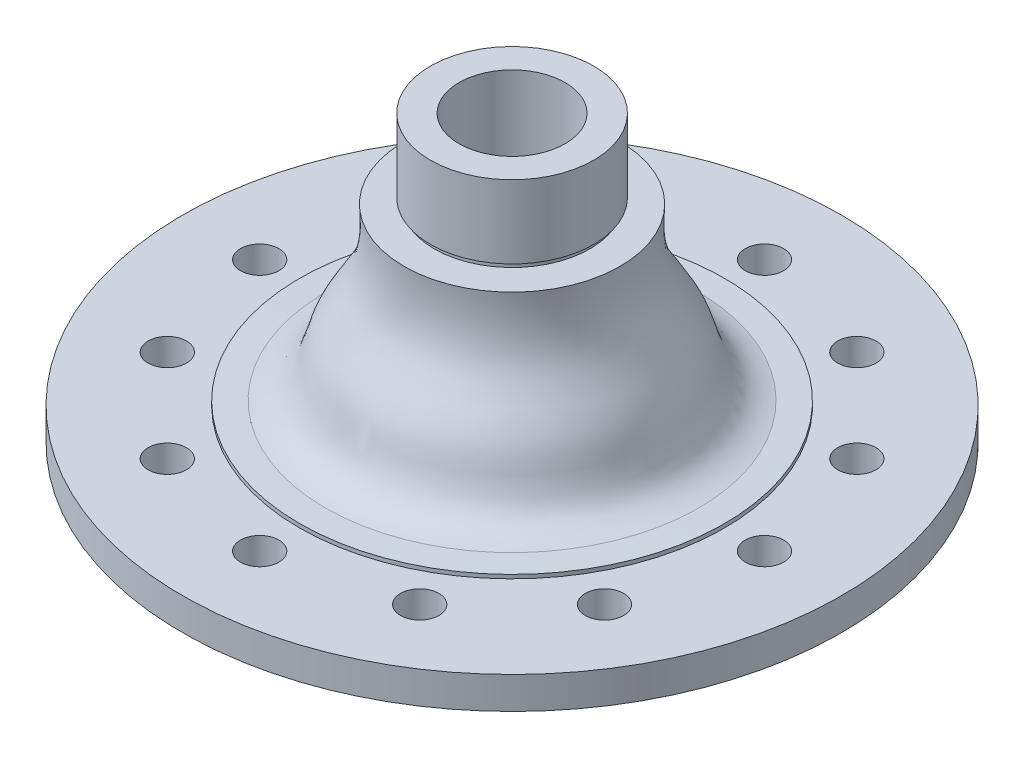
ISO-10303-21;
HEADER;
FILE_DESCRIPTION(('STEP AP214'),'2;1');
FILE_NAME('part.step','',(''),(''),'','','');
FILE_SCHEMA(('AUTOMOTIVE_DESIGN { 1 0 10303 214 1 1 1 1 }'));
ENDSEC;
DATA;
#1=APPLICATION_CONTEXT('core data for automotive mechanical design processes');
#2=APPLICATION_PROTOCOL_DEFINITION('international standard','automotive_design',2000,#1);
#3=PRODUCT_CONTEXT('',#1,'mechanical');
#4=PRODUCT('Part','Part','',(#3));
#5=PRODUCT_RELATED_PRODUCT_CATEGORY('part','',(#4));
#6=PRODUCT_DEFINITION_FORMATION('','',#4);
#7=PRODUCT_DEFINITION_CONTEXT('part definition',#1,'design');
#8=PRODUCT_DEFINITION('design','',#6,#7);
#9=PRODUCT_DEFINITION_SHAPE('','',#8);
#10=(LENGTH_UNIT() NAMED_UNIT(*) SI_UNIT(.MILLI.,.METRE.));
#11=(NAMED_UNIT(*) PLANE_ANGLE_UNIT() SI_UNIT($,.RADIAN.));
#12=(NAMED_UNIT(*) SI_UNIT($,.STERADIAN.) SOLID_ANGLE_UNIT());
#13=UNCERTAINTY_MEASURE_WITH_UNIT(LENGTH_MEASURE(1.E-05),#10,'distance_accuracy_value','');
#14=(GEOMETRIC_REPRESENTATION_CONTEXT(3) GLOBAL_UNCERTAINTY_ASSIGNED_CONTEXT((#13)) GLOBAL_UNIT_ASSIGNED_CONTEXT((#10,
#11,#12)) REPRESENTATION_CONTEXT('',''));
#15=CARTESIAN_POINT('',(0.,0.,0.));
#16=DIRECTION('',(0.,0.,1.));
#17=DIRECTION('',(1.,0.,0.));
#18=AXIS2_PLACEMENT_3D('',#15,#16,#17);
#19=CARTESIAN_POINT('',(599.514440137728,-164.221002071688,0.));
#20=DIRECTION('',(0.,-1.,0.));
#21=DIRECTION('',(0.,0.,-1.));
#22=AXIS2_PLACEMENT_3D('',#19,#20,#21);
#23=CONICAL_SURFACE('',#22,116.160980779473,1.54633855687659);
#24=CARTESIAN_POINT('',(599.514440137728,-163.876181957861,0.));
#25=DIRECTION('',(0.,1.,0.));
#26=DIRECTION('',(0.,0.,1.));
#27=AXIS2_PLACEMENT_3D('',#24,#25,#26);
#28=CIRCLE('',#27,102.065200292674);
#29=CARTESIAN_POINT('',(599.514440137728,-163.876181957861,102.065200292674));
#30=VERTEX_POINT('',#29);
#31=EDGE_CURVE('E10',#30,#30,#28,.T.);
#32=ORIENTED_EDGE('',*,*,#31,.F.);
#33=EDGE_LOOP('',(#32));
#34=FACE_BOUND('',#33,.T.);
#35=CARTESIAN_POINT('',(599.514440137728,-164.221002071688,0.));
#36=DIRECTION('',(0.,1.,0.));
#37=DIRECTION('',(0.,0.,1.));
#38=AXIS2_PLACEMENT_3D('',#35,#36,#37);
#39=CIRCLE('',#38,116.160980779473);
#40=CARTESIAN_POINT('',(599.514440137728,-164.221002071688,116.160980779473));
#41=VERTEX_POINT('',#40);
#42=EDGE_CURVE('E93',#41,#41,#39,.T.);
#43=ORIENTED_EDGE('',*,*,#42,.T.);
#44=EDGE_LOOP('',(#43));
#45=FACE_BOUND('',#44,.T.);
#46=ADVANCED_FACE('F35',(#34,#45),#23,.T.);
#47=CARTESIAN_POINT('',(701.579640430402,-163.876181957861,0.));
#48=CARTESIAN_POINT('',(696.836978512838,-162.87382038747,0.));
#49=CARTESIAN_POINT('',(682.485210268226,-157.676172339236,0.));
#50=CARTESIAN_POINT('',(679.945843963378,-129.423738670763,0.));
#51=CARTESIAN_POINT('',(658.48169900372,-105.854615847683,0.));
#52=CARTESIAN_POINT('',(657.726950227453,-82.125755959732,0.));
#53=CARTESIAN_POINT('',(658.548500631912,-70.9857186283268,0.));
#54=B_SPLINE_CURVE_WITH_KNOTS('',3,(#47,#48,#49,#50,#51,#52,#53),.UNSPECIFIED.,.F.,.F.,(4,1,1,1,
4),(0.,1057.43030810282,2997.11106282431,5402.74320491823,7834.14823487199),.UNSPECIFIED.);
#55=CARTESIAN_POINT('',(599.514440137728,-67.3889032535712,0.));
#56=DIRECTION('',(0.,1.,0.));
#57=AXIS1_PLACEMENT('',#55,#56);
#58=SURFACE_OF_REVOLUTION('',#54,#57);
#59=CARTESIAN_POINT('',(599.514440137728,-70.9857186283268,0.));
#60=DIRECTION('',(0.,1.,0.));
#61=DIRECTION('',(0.,0.,1.));
#62=AXIS2_PLACEMENT_3D('',#59,#60,#61);
#63=CIRCLE('',#62,59.0340604941841);
#64=CARTESIAN_POINT('',(599.514440137728,-70.9857186283268,59.0340604941841));
#65=VERTEX_POINT('',#64);
#66=EDGE_CURVE('E41',#65,#65,#63,.T.);
#67=ORIENTED_EDGE('',*,*,#66,.F.);
#68=EDGE_LOOP('',(#67));
#69=FACE_BOUND('',#68,.T.);
#70=ORIENTED_EDGE('',*,*,#31,.T.);
#71=EDGE_LOOP('',(#70));
#72=FACE_BOUND('',#71,.T.);
#73=ADVANCED_FACE('F150',(#69,#72),#58,.T.);
#74=CARTESIAN_POINT('',(1.78995327775374E-13,-70.9857186283268,0.));
#75=DIRECTION('',(0.,-1.,0.));
#76=DIRECTION('',(0.,0.,-1.));
#77=AXIS2_PLACEMENT_3D('',#74,#75,#76);
#78=PLANE('',#77);
#79=CARTESIAN_POINT('',(599.514440137728,-70.9857186283268,0.));
#80=DIRECTION('',(0.,1.,0.));
#81=DIRECTION('',(0.,0.,1.));
#82=AXIS2_PLACEMENT_3D('',#79,#80,#81);
#83=CIRCLE('',#82,42.5231590183854);
#84=CARTESIAN_POINT('',(599.514440137728,-70.9857186283268,42.5231590183854));
#85=VERTEX_POINT('',#84);
#86=EDGE_CURVE('E45',#85,#85,#83,.T.);
#87=ORIENTED_EDGE('',*,*,#86,.F.);
#88=EDGE_LOOP('',(#87));
#89=FACE_BOUND('',#88,.T.);
#90=ORIENTED_EDGE('',*,*,#66,.T.);
#91=EDGE_LOOP('',(#90));
#92=FACE_BOUND('',#91,.T.);
#93=ADVANCED_FACE('F147',(#89,#92),#78,.F.);
#94=CARTESIAN_POINT('',(599.514440137728,-67.3889032535712,0.));
#95=DIRECTION('',(0.,1.,0.));
#96=DIRECTION('',(0.,0.,1.));
#97=AXIS2_PLACEMENT_3D('',#94,#95,#96);
#98=CYLINDRICAL_SURFACE('',#97,42.5231590183854);
#99=CARTESIAN_POINT('',(599.514440137728,-67.8359145091373,0.));
#100=DIRECTION('',(0.,1.,0.));
#101=DIRECTION('',(0.,0.,1.));
#102=AXIS2_PLACEMENT_3D('',#99,#100,#101);
#103=CIRCLE('',#102,42.5231590183854);
#104=CARTESIAN_POINT('',(599.514440137728,-67.8359145091373,42.5231590183854));
#105=VERTEX_POINT('',#104);
#106=EDGE_CURVE('E49',#105,#105,#103,.T.);
#107=ORIENTED_EDGE('',*,*,#106,.F.);
#108=EDGE_LOOP('',(#107));
#109=FACE_BOUND('',#108,.T.);
#110=ORIENTED_EDGE('',*,*,#86,.T.);
#111=EDGE_LOOP('',(#110));
#112=FACE_BOUND('',#111,.T.);
#113=ADVANCED_FACE('F143',(#109,#112),#98,.T.);
#114=CARTESIAN_POINT('',(0.,-67.8359145091373,0.));
#115=DIRECTION('',(0.,1.,0.));
#116=DIRECTION('',(0.,0.,1.));
#117=AXIS2_PLACEMENT_3D('',#114,#115,#116);
#118=PLANE('',#117);
#119=CARTESIAN_POINT('',(599.514440137728,-67.8359145091373,0.));
#120=DIRECTION('',(0.,1.,0.));
#121=DIRECTION('',(0.,0.,1.));
#122=AXIS2_PLACEMENT_3D('',#119,#120,#121);
#123=CIRCLE('',#122,44.6222250218502);
#124=CARTESIAN_POINT('',(599.514440137728,-67.8359145091373,44.6222250218502));
#125=VERTEX_POINT('',#124);
#126=EDGE_CURVE('E54',#125,#125,#123,.T.);
#127=ORIENTED_EDGE('',*,*,#126,.F.);
#128=EDGE_LOOP('',(#127));
#129=FACE_BOUND('',#128,.T.);
#130=ORIENTED_EDGE('',*,*,#106,.T.);
#131=EDGE_LOOP('',(#130));
#132=FACE_BOUND('',#131,.T.);
#133=ADVANCED_FACE('F139',(#129,#132),#118,.F.);
#134=CARTESIAN_POINT('',(599.514440137728,-67.3889032535712,0.));
#135=DIRECTION('',(0.,1.,0.));
#136=DIRECTION('',(0.,0.,1.));
#137=AXIS2_PLACEMENT_3D('',#134,#135,#136);
#138=CYLINDRICAL_SURFACE('',#137,44.6222250218502);
#139=ORIENTED_EDGE('',*,*,#126,.T.);
#140=EDGE_LOOP('',(#139));
#141=FACE_BOUND('',#140,.T.);
#142=CARTESIAN_POINT('',(599.514440137728,-27.9383956660702,0.));
#143=DIRECTION('',(0.,1.,0.));
#144=DIRECTION('',(0.,0.,1.));
#145=AXIS2_PLACEMENT_3D('',#142,#143,#144);
#146=CIRCLE('',#145,44.6222250218502);
#147=CARTESIAN_POINT('',(599.514440137728,-27.9383956660702,44.6222250218502));
#148=VERTEX_POINT('',#147);
#149=EDGE_CURVE('E57',#148,#148,#146,.T.);
#150=ORIENTED_EDGE('',*,*,#149,.F.);
#151=EDGE_LOOP('',(#150));
#152=FACE_BOUND('',#151,.T.);
#153=ADVANCED_FACE('F135',(#141,#152),#138,.T.);
#154=CARTESIAN_POINT('',(0.,-27.9383956660702,0.));
#155=DIRECTION('',(0.,1.,0.));
#156=DIRECTION('',(0.,0.,1.));
#157=AXIS2_PLACEMENT_3D('',#154,#155,#156);
#158=PLANE('',#157);
#159=ORIENTED_EDGE('',*,*,#149,.T.);
#160=EDGE_LOOP('',(#159));
#161=FACE_BOUND('',#160,.T.);
#162=CARTESIAN_POINT('',(599.514440137728,-27.9383956660702,0.));
#163=DIRECTION('',(0.,1.,0.));
#164=DIRECTION('',(0.,0.,1.));
#165=AXIS2_PLACEMENT_3D('',#162,#163,#164);
#166=CIRCLE('',#165,28.9999999999992);
#167=CARTESIAN_POINT('',(599.514440137728,-27.9383956660702,28.9999999999992));
#168=VERTEX_POINT('',#167);
#169=EDGE_CURVE('E60',#168,#168,#166,.T.);
#170=ORIENTED_EDGE('',*,*,#169,.F.);
#171=EDGE_LOOP('',(#170));
#172=FACE_BOUND('',#171,.T.);
#173=ADVANCED_FACE('F131',(#161,#172),#158,.T.);
#174=CARTESIAN_POINT('',(599.514440137728,-67.3889032535712,0.));
#175=DIRECTION('',(0.,1.,0.));
#176=DIRECTION('',(0.,0.,1.));
#177=AXIS2_PLACEMENT_3D('',#174,#175,#176);
#178=CYLINDRICAL_SURFACE('',#177,28.9999999999994);
#179=ORIENTED_EDGE('',*,*,#169,.T.);
#180=EDGE_LOOP('',(#179));
#181=FACE_BOUND('',#180,.T.);
#182=CARTESIAN_POINT('',(599.514440137728,-106.839410841068,0.));
#183=DIRECTION('',(0.,1.,0.));
#184=DIRECTION('',(0.,0.,1.));
#185=AXIS2_PLACEMENT_3D('',#182,#183,#184);
#186=CIRCLE('',#185,28.9999999999996);
#187=CARTESIAN_POINT('',(599.514440137728,-106.839410841068,28.9999999999996));
#188=VERTEX_POINT('',#187);
#189=EDGE_CURVE('E63',#188,#188,#186,.T.);
#190=ORIENTED_EDGE('',*,*,#189,.F.);
#191=EDGE_LOOP('',(#190));
#192=FACE_BOUND('',#191,.T.);
#193=ADVANCED_FACE('F127',(#181,#192),#178,.F.);
#194=CARTESIAN_POINT('',(0.,-106.839410841068,0.));
#195=DIRECTION('',(0.,-1.,0.));
#196=DIRECTION('',(0.,0.,-1.));
#197=AXIS2_PLACEMENT_3D('',#194,#195,#196);
#198=PLANE('',#197);
#199=ORIENTED_EDGE('',*,*,#189,.T.);
#200=EDGE_LOOP('',(#199));
#201=FACE_BOUND('',#200,.T.);
#202=CARTESIAN_POINT('',(599.514440137728,-106.839410841068,0.));
#203=DIRECTION('',(0.,1.,0.));
#204=DIRECTION('',(0.,0.,1.));
#205=AXIS2_PLACEMENT_3D('',#202,#203,#204);
#206=CIRCLE('',#205,44.6230284311797);
#207=CARTESIAN_POINT('',(599.514440137728,-106.839410841068,44.6230284311797));
#208=VERTEX_POINT('',#207);
#209=EDGE_CURVE('E66',#208,#208,#206,.T.);
#210=ORIENTED_EDGE('',*,*,#209,.F.);
#211=EDGE_LOOP('',(#210));
#212=FACE_BOUND('',#211,.T.);
#213=ADVANCED_FACE('F123',(#201,#212),#198,.T.);
#214=CARTESIAN_POINT('',(599.514440137728,-67.3889032535712,0.));
#215=DIRECTION('',(0.,1.,0.));
#216=DIRECTION('',(0.,0.,1.));
#217=AXIS2_PLACEMENT_3D('',#214,#215,#216);
#218=CYLINDRICAL_SURFACE('',#217,44.6230284311802);
#219=ORIENTED_EDGE('',*,*,#209,.T.);
#220=EDGE_LOOP('',(#219));
#221=FACE_BOUND('',#220,.T.);
#222=CARTESIAN_POINT('',(599.514440137728,-156.607948670613,0.));
#223=DIRECTION('',(0.,1.,0.));
#224=DIRECTION('',(0.,0.,1.));
#225=AXIS2_PLACEMENT_3D('',#222,#223,#224);
#226=CIRCLE('',#225,44.6230284311806);
#227=CARTESIAN_POINT('',(599.514440137728,-156.607948670613,44.6230284311806));
#228=VERTEX_POINT('',#227);
#229=EDGE_CURVE('E69',#228,#228,#226,.T.);
#230=ORIENTED_EDGE('',*,*,#229,.F.);
#231=EDGE_LOOP('',(#230));
#232=FACE_BOUND('',#231,.T.);
#233=ADVANCED_FACE('F119',(#221,#232),#218,.F.);
#234=CARTESIAN_POINT('',(2.72905507681014E-13,-156.607948670613,0.));
#235=DIRECTION('',(0.,-1.,0.));
#236=DIRECTION('',(0.,0.,-1.));
#237=AXIS2_PLACEMENT_3D('',#234,#235,#236);
#238=PLANE('',#237);
#239=ORIENTED_EDGE('',*,*,#229,.T.);
#240=EDGE_LOOP('',(#239));
#241=FACE_BOUND('',#240,.T.);
#242=CARTESIAN_POINT('',(599.514440137728,-156.607948670613,0.));
#243=DIRECTION('',(0.,1.,0.));
#244=DIRECTION('',(0.,0.,1.));
#245=AXIS2_PLACEMENT_3D('',#242,#243,#244);
#246=CIRCLE('',#245,60.5506797207122);
#247=CARTESIAN_POINT('',(599.514440137728,-156.607948670613,60.5506797207122));
#248=VERTEX_POINT('',#247);
#249=EDGE_CURVE('E72',#248,#248,#246,.T.);
#250=ORIENTED_EDGE('',*,*,#249,.F.);
#251=EDGE_LOOP('',(#250));
#252=FACE_BOUND('',#251,.T.);
#253=ADVANCED_FACE('F114',(#241,#252),#238,.T.);
#254=CARTESIAN_POINT('',(660.06511985844,-156.607948670613,0.));
#255=CARTESIAN_POINT('',(663.097961625083,-156.988826470721,0.));
#256=CARTESIAN_POINT('',(667.510654429455,-158.674715159286,0.));
#257=CARTESIAN_POINT('',(674.048768019829,-164.837934220359,0.));
#258=CARTESIAN_POINT('',(674.645699136105,-171.62161598856,0.));
#259=CARTESIAN_POINT('',(673.724213487887,-175.886758840643,0.));
#260=B_SPLINE_CURVE_WITH_KNOTS('',3,(#254,#255,#256,#257,#258,#259),.UNSPECIFIED.,.F.,.F.,(4,1,
1,4),(0.,2126.07147958089,3119.44722831095,6154.52752992671),.UNSPECIFIED.);
#261=CARTESIAN_POINT('',(599.514440137728,-67.3889032535712,0.));
#262=DIRECTION('',(0.,1.,0.));
#263=AXIS1_PLACEMENT('',#261,#262);
#264=SURFACE_OF_REVOLUTION('',#260,#263);
#265=CARTESIAN_POINT('',(599.514440137728,-175.886758840643,0.));
#266=DIRECTION('',(0.,1.,0.));
#267=DIRECTION('',(0.,0.,1.));
#268=AXIS2_PLACEMENT_3D('',#265,#266,#267);
#269=CIRCLE('',#268,74.2097733501593);
#270=CARTESIAN_POINT('',(599.514440137728,-175.886758840643,74.2097733501593));
#271=VERTEX_POINT('',#270);
#272=EDGE_CURVE('E75',#271,#271,#269,.T.);
#273=ORIENTED_EDGE('',*,*,#272,.F.);
#274=EDGE_LOOP('',(#273));
#275=FACE_BOUND('',#274,.T.);
#276=ORIENTED_EDGE('',*,*,#249,.T.);
#277=EDGE_LOOP('',(#276));
#278=FACE_BOUND('',#277,.T.);
#279=ADVANCED_FACE('F109',(#275,#278),#264,.T.);
#280=CARTESIAN_POINT('',(599.514440137728,-207.070159572736,0.));
#281=DIRECTION('',(0.,1.,0.));
#282=DIRECTION('',(0.,0.,1.));
#283=AXIS2_PLACEMENT_3D('',#280,#281,#282);
#284=DEGENERATE_TOROIDAL_SURFACE('',#283,15.3458637109525,66.613544713001,.T.);
#285=ORIENTED_EDGE('',*,*,#272,.T.);
#286=EDGE_LOOP('',(#285));
#287=FACE_BOUND('',#286,.T.);
#288=CARTESIAN_POINT('',(599.514440137728,-199.594402961231,0.));
#289=DIRECTION('',(0.,1.,0.));
#290=DIRECTION('',(0.,0.,1.));
#291=AXIS2_PLACEMENT_3D('',#288,#289,#290);
#292=CIRCLE('',#291,81.5385929364235);
#293=CARTESIAN_POINT('',(599.514440137728,-199.594402961231,81.5385929364235));
#294=VERTEX_POINT('',#293);
#295=EDGE_CURVE('E78',#294,#294,#292,.T.);
#296=ORIENTED_EDGE('',*,*,#295,.F.);
#297=EDGE_LOOP('',(#296));
#298=FACE_BOUND('',#297,.T.);
#299=ADVANCED_FACE('F113',(#287,#298),#284,.F.);
#300=CARTESIAN_POINT('',(0.,-199.594402961231,0.));
#301=DIRECTION('',(0.,-1.,0.));
#302=DIRECTION('',(0.,0.,-1.));
#303=AXIS2_PLACEMENT_3D('',#300,#301,#302);
#304=PLANE('',#303);
#305=ORIENTED_EDGE('',*,*,#295,.T.);
#306=EDGE_LOOP('',(#305));
#307=FACE_BOUND('',#306,.T.);
#308=CARTESIAN_POINT('',(599.514440137728,-199.594402961231,0.));
#309=DIRECTION('',(0.,1.,0.));
#310=DIRECTION('',(0.,0.,1.));
#311=AXIS2_PLACEMENT_3D('',#308,#309,#310);
#312=CIRCLE('',#311,119.41251949035);
#313=CARTESIAN_POINT('',(599.514440137728,-199.594402961231,119.41251949035));
#314=VERTEX_POINT('',#313);
#315=EDGE_CURVE('E81',#314,#314,#312,.T.);
#316=ORIENTED_EDGE('',*,*,#315,.F.);
#317=EDGE_LOOP('',(#316));
#318=FACE_BOUND('',#317,.T.);
#319=ADVANCED_FACE('F190',(#307,#318),#304,.T.);
#320=CARTESIAN_POINT('',(599.514440137728,-67.3889032535712,0.));
#321=DIRECTION('',(0.,1.,0.));
#322=DIRECTION('',(0.,0.,1.));
#323=AXIS2_PLACEMENT_3D('',#320,#321,#322);
#324=CYLINDRICAL_SURFACE('',#323,119.41251949035);
#325=ORIENTED_EDGE('',*,*,#315,.T.);
#326=EDGE_LOOP('',(#325));
#327=FACE_BOUND('',#326,.T.);
#328=CARTESIAN_POINT('',(599.514440137728,-189.09892065135,0.));
#329=DIRECTION('',(0.,1.,0.));
#330=DIRECTION('',(0.,0.,1.));
#331=AXIS2_PLACEMENT_3D('',#328,#329,#330);
#332=CIRCLE('',#331,119.41251949035);
#333=CARTESIAN_POINT('',(599.514440137728,-189.09892065135,119.41251949035));
#334=VERTEX_POINT('',#333);
#335=EDGE_CURVE('E84',#334,#334,#332,.T.);
#336=ORIENTED_EDGE('',*,*,#335,.F.);
#337=EDGE_LOOP('',(#336));
#338=FACE_BOUND('',#337,.T.);
#339=ADVANCED_FACE('F187',(#327,#338),#324,.T.);
#340=CARTESIAN_POINT('',(599.514440137728,-189.098920651352,0.));
#341=DIRECTION('',(0.,1.,0.));
#342=DIRECTION('',(0.,0.,1.));
#343=AXIS2_PLACEMENT_3D('',#340,#341,#342);
#344=TOROIDAL_SURFACE('',#343,124.662193022577,5.24967353222729);
#345=ORIENTED_EDGE('',*,*,#335,.T.);
#346=EDGE_LOOP('',(#345));
#347=FACE_BOUND('',#346,.T.);
#348=CARTESIAN_POINT('',(599.514440137728,-183.849247119125,0.));
#349=DIRECTION('',(0.,1.,0.));
#350=DIRECTION('',(0.,0.,1.));
#351=AXIS2_PLACEMENT_3D('',#348,#349,#350);
#352=CIRCLE('',#351,124.662193020868);
#353=CARTESIAN_POINT('',(599.514440137728,-183.849247119125,124.662193020868));
#354=VERTEX_POINT('',#353);
#355=EDGE_CURVE('E87',#354,#354,#352,.T.);
#356=ORIENTED_EDGE('',*,*,#355,.F.);
#357=EDGE_LOOP('',(#356));
#358=FACE_BOUND('',#357,.T.);
#359=ADVANCED_FACE('F183',(#347,#358),#344,.F.);
#360=CARTESIAN_POINT('',(0.,-183.849247119125,0.));
#361=DIRECTION('',(0.,-1.,0.));
#362=DIRECTION('',(0.,0.,-1.));
#363=AXIS2_PLACEMENT_3D('',#360,#361,#362);
#364=PLANE('',#363);
#365=CARTESIAN_POINT('',(480.002934415475,-183.849247119125,-68.9999999999985));
#366=DIRECTION('',(0.,-1.,0.));
#367=DIRECTION('',(0.,0.,-1.));
#368=AXIS2_PLACEMENT_3D('',#365,#366,#367);
#369=CIRCLE('',#368,10.5);
#370=CARTESIAN_POINT('',(480.002934415475,-183.849247119125,-79.4999999999985));
#371=VERTEX_POINT('',#370);
#372=EDGE_CURVE('E279',#371,#371,#369,.T.);
#373=ORIENTED_EDGE('',*,*,#372,.F.);
#374=EDGE_LOOP('',(#373));
#375=FACE_BOUND('',#374,.T.);
#376=CARTESIAN_POINT('',(530.514440137727,-183.849247119125,-119.511505722252));
#377=DIRECTION('',(0.,-1.,0.));
#378=DIRECTION('',(0.,0.,-1.));
#379=AXIS2_PLACEMENT_3D('',#376,#377,#378);
#380=CIRCLE('',#379,10.5);
#381=CARTESIAN_POINT('',(530.514440137727,-183.849247119125,-130.011505722252));
#382=VERTEX_POINT('',#381);
#383=EDGE_CURVE('E273',#382,#382,#380,.T.);
#384=ORIENTED_EDGE('',*,*,#383,.F.);
#385=EDGE_LOOP('',(#384));
#386=FACE_BOUND('',#385,.T.);
#387=CARTESIAN_POINT('',(599.514440137727,-183.849247119125,-138.));
#388=DIRECTION('',(0.,-1.,0.));
#389=DIRECTION('',(0.,0.,-1.));
#390=AXIS2_PLACEMENT_3D('',#387,#388,#389);
#391=CIRCLE('',#390,10.5);
#392=CARTESIAN_POINT('',(599.514440137727,-183.849247119125,-148.5));
#393=VERTEX_POINT('',#392);
#394=EDGE_CURVE('E267',#393,#393,#391,.T.);
#395=ORIENTED_EDGE('',*,*,#394,.F.);
#396=EDGE_LOOP('',(#395));
#397=FACE_BOUND('',#396,.T.);
#398=CARTESIAN_POINT('',(668.514440137727,-183.849247119125,-119.511505722253));
#399=DIRECTION('',(0.,-1.,0.));
#400=DIRECTION('',(0.,0.,-1.));
#401=AXIS2_PLACEMENT_3D('',#398,#399,#400);
#402=CIRCLE('',#401,10.5);
#403=CARTESIAN_POINT('',(668.514440137727,-183.849247119125,-130.011505722253));
#404=VERTEX_POINT('',#403);
#405=EDGE_CURVE('E261',#404,#404,#402,.T.);
#406=ORIENTED_EDGE('',*,*,#405,.F.);
#407=EDGE_LOOP('',(#406));
#408=FACE_BOUND('',#407,.T.);
#409=CARTESIAN_POINT('',(719.02594585998,-183.849247119125,-69.000000000001));
#410=DIRECTION('',(0.,-1.,0.));
#411=DIRECTION('',(0.,0.,-1.));
#412=AXIS2_PLACEMENT_3D('',#409,#410,#411);
#413=CIRCLE('',#412,10.5);
#414=CARTESIAN_POINT('',(719.02594585998,-183.849247119125,-79.500000000001));
#415=VERTEX_POINT('',#414);
#416=EDGE_CURVE('E255',#415,#415,#413,.T.);
#417=ORIENTED_EDGE('',*,*,#416,.F.);
#418=EDGE_LOOP('',(#417));
#419=FACE_BOUND('',#418,.T.);
#420=CARTESIAN_POINT('',(737.514440137728,-183.849247119125,0.));
#421=DIRECTION('',(0.,-1.,0.));
#422=DIRECTION('',(0.,0.,-1.));
#423=AXIS2_PLACEMENT_3D('',#420,#421,#422);
#424=CIRCLE('',#423,10.5);
#425=CARTESIAN_POINT('',(737.514440137728,-183.849247119125,-10.5));
#426=VERTEX_POINT('',#425);
#427=EDGE_CURVE('E249',#426,#426,#424,.T.);
#428=ORIENTED_EDGE('',*,*,#427,.F.);
#429=EDGE_LOOP('',(#428));
#430=FACE_BOUND('',#429,.T.);
#431=CARTESIAN_POINT('',(719.025945859981,-183.849247119125,68.9999999999993));
#432=DIRECTION('',(0.,-1.,0.));
#433=DIRECTION('',(0.,0.,-1.));
#434=AXIS2_PLACEMENT_3D('',#431,#432,#433);
#435=CIRCLE('',#434,10.5);
#436=CARTESIAN_POINT('',(719.025945859981,-183.849247119125,58.4999999999993));
#437=VERTEX_POINT('',#436);
#438=EDGE_CURVE('E243',#437,#437,#435,.T.);
#439=ORIENTED_EDGE('',*,*,#438,.F.);
#440=EDGE_LOOP('',(#439));
#441=FACE_BOUND('',#440,.T.);
#442=CARTESIAN_POINT('',(668.514440137729,-183.849247119125,119.511505722252));
#443=DIRECTION('',(0.,-1.,0.));
#444=DIRECTION('',(0.,0.,-1.));
#445=AXIS2_PLACEMENT_3D('',#442,#443,#444);
#446=CIRCLE('',#445,10.5);
#447=CARTESIAN_POINT('',(668.514440137729,-183.849247119125,109.011505722252));
#448=VERTEX_POINT('',#447);
#449=EDGE_CURVE('E237',#448,#448,#446,.T.);
#450=ORIENTED_EDGE('',*,*,#449,.F.);
#451=EDGE_LOOP('',(#450));
#452=FACE_BOUND('',#451,.T.);
#453=CARTESIAN_POINT('',(599.514440137729,-183.849247119125,138.));
#454=DIRECTION('',(0.,-1.,0.));
#455=DIRECTION('',(0.,0.,-1.));
#456=AXIS2_PLACEMENT_3D('',#453,#454,#455);
#457=CIRCLE('',#456,10.5);
#458=CARTESIAN_POINT('',(599.514440137729,-183.849247119125,127.5));
#459=VERTEX_POINT('',#458);
#460=EDGE_CURVE('E231',#459,#459,#457,.T.);
#461=ORIENTED_EDGE('',*,*,#460,.F.);
#462=EDGE_LOOP('',(#461));
#463=FACE_BOUND('',#462,.T.);
#464=CARTESIAN_POINT('',(530.514440137728,-183.849247119125,119.511505722253));
#465=DIRECTION('',(0.,-1.,0.));
#466=DIRECTION('',(0.,0.,-1.));
#467=AXIS2_PLACEMENT_3D('',#464,#465,#466);
#468=CIRCLE('',#467,10.5);
#469=CARTESIAN_POINT('',(530.514440137728,-183.849247119125,109.011505722253));
#470=VERTEX_POINT('',#469);
#471=EDGE_CURVE('E225',#470,#470,#468,.T.);
#472=ORIENTED_EDGE('',*,*,#471,.F.);
#473=EDGE_LOOP('',(#472));
#474=FACE_BOUND('',#473,.T.);
#475=CARTESIAN_POINT('',(480.002934415476,-183.849247119125,69.0000000000001));
#476=DIRECTION('',(0.,-1.,0.));
#477=DIRECTION('',(0.,0.,-1.));
#478=AXIS2_PLACEMENT_3D('',#475,#476,#477);
#479=CIRCLE('',#478,10.5);
#480=CARTESIAN_POINT('',(480.002934415476,-183.849247119125,58.5000000000001));
#481=VERTEX_POINT('',#480);
#482=EDGE_CURVE('E219',#481,#481,#479,.T.);
#483=ORIENTED_EDGE('',*,*,#482,.F.);
#484=EDGE_LOOP('',(#483));
#485=FACE_BOUND('',#484,.T.);
#486=CARTESIAN_POINT('',(461.514440137728,-183.849247119125,0.));
#487=DIRECTION('',(0.,-1.,0.));
#488=DIRECTION('',(0.,0.,-1.));
#489=AXIS2_PLACEMENT_3D('',#486,#487,#488);
#490=CIRCLE('',#489,10.5);
#491=CARTESIAN_POINT('',(461.514440137728,-183.849247119125,-10.5));
#492=VERTEX_POINT('',#491);
#493=EDGE_CURVE('E211',#492,#492,#490,.T.);
#494=ORIENTED_EDGE('',*,*,#493,.F.);
#495=EDGE_LOOP('',(#494));
#496=FACE_BOUND('',#495,.T.);
#497=ORIENTED_EDGE('',*,*,#355,.T.);
#498=EDGE_LOOP('',(#497));
#499=FACE_BOUND('',#498,.T.);
#500=CARTESIAN_POINT('',(599.514440137728,-183.849247119125,0.));
#501=DIRECTION('',(0.,-1.,0.));
#502=DIRECTION('',(0.,0.,-1.));
#503=AXIS2_PLACEMENT_3D('',#500,#501,#502);
#504=CIRCLE('',#503,180.194972746709);
#505=CARTESIAN_POINT('',(599.514440137728,-183.849247119125,-180.194972746709));
#506=VERTEX_POINT('',#505);
#507=EDGE_CURVE('E96',#506,#506,#504,.T.);
#508=ORIENTED_EDGE('',*,*,#507,.T.);
#509=EDGE_LOOP('',(#508));
#510=FACE_BOUND('',#509,.T.);
#511=ADVANCED_FACE('F176',(#375,#386,#397,#408,#419,#430,#441,#452,#463,#474,#485,#496,#499,
#510),#364,.T.);
#512=CARTESIAN_POINT('',(0.,-166.320871484481,0.));
#513=DIRECTION('',(0.,1.,0.));
#514=DIRECTION('',(0.,0.,1.));
#515=AXIS2_PLACEMENT_3D('',#512,#513,#514);
#516=PLANE('',#515);
#517=CARTESIAN_POINT('',(480.002934415475,-166.320871484481,-68.9999999999985));
#518=DIRECTION('',(0.,1.,0.));
#519=DIRECTION('',(-0.499999999999989,0.,0.866025403784445));
#520=AXIS2_PLACEMENT_3D('',#517,#518,#519);
#521=CIRCLE('',#520,10.5);
#522=CARTESIAN_POINT('',(474.752934415475,-166.320871484481,-59.9067332602618));
#523=VERTEX_POINT('',#522);
#524=EDGE_CURVE('E282',#523,#523,#521,.T.);
#525=ORIENTED_EDGE('',*,*,#524,.F.);
#526=EDGE_LOOP('',(#525));
#527=FACE_BOUND('',#526,.T.);
#528=CARTESIAN_POINT('',(530.514440137727,-166.320871484481,-119.511505722252));
#529=DIRECTION('',(0.,1.,0.));
#530=DIRECTION('',(-0.866025403784433,0.,0.50000000000001));
#531=AXIS2_PLACEMENT_3D('',#528,#529,#530);
#532=CIRCLE('',#531,10.5);
#533=CARTESIAN_POINT('',(521.42117339799,-166.320871484481,-114.261505722252));
#534=VERTEX_POINT('',#533);
#535=EDGE_CURVE('E276',#534,#534,#532,.T.);
#536=ORIENTED_EDGE('',*,*,#535,.F.);
#537=EDGE_LOOP('',(#536));
#538=FACE_BOUND('',#537,.T.);
#539=CARTESIAN_POINT('',(599.514440137727,-166.320871484481,-138.));
#540=DIRECTION('',(0.,1.,0.));
#541=DIRECTION('',(-1.,0.,0.));
#542=AXIS2_PLACEMENT_3D('',#539,#540,#541);
#543=CIRCLE('',#542,10.5);
#544=CARTESIAN_POINT('',(589.014440137727,-166.320871484481,-138.));
#545=VERTEX_POINT('',#544);
#546=EDGE_CURVE('E270',#545,#545,#543,.T.);
#547=ORIENTED_EDGE('',*,*,#546,.F.);
#548=EDGE_LOOP('',(#547));
#549=FACE_BOUND('',#548,.T.);
#550=CARTESIAN_POINT('',(668.514440137727,-166.320871484481,-119.511505722253));
#551=DIRECTION('',(0.,1.,0.));
#552=DIRECTION('',(-0.866025403784443,0.,-0.499999999999992));
#553=AXIS2_PLACEMENT_3D('',#550,#551,#552);
#554=CIRCLE('',#553,10.5);
#555=CARTESIAN_POINT('',(659.42117339799,-166.320871484481,-124.761505722253));
#556=VERTEX_POINT('',#555);
#557=EDGE_CURVE('E264',#556,#556,#554,.T.);
#558=ORIENTED_EDGE('',*,*,#557,.F.);
#559=EDGE_LOOP('',(#558));
#560=FACE_BOUND('',#559,.T.);
#561=CARTESIAN_POINT('',(719.02594585998,-166.320871484481,-69.000000000001));
#562=DIRECTION('',(0.,1.,0.));
#563=DIRECTION('',(-0.500000000000007,0.,-0.866025403784435));
#564=AXIS2_PLACEMENT_3D('',#561,#562,#563);
#565=CIRCLE('',#564,10.5);
#566=CARTESIAN_POINT('',(713.77594585998,-166.320871484481,-78.0932667397376));
#567=VERTEX_POINT('',#566);
#568=EDGE_CURVE('E258',#567,#567,#565,.T.);
#569=ORIENTED_EDGE('',*,*,#568,.F.);
#570=EDGE_LOOP('',(#569));
#571=FACE_BOUND('',#570,.T.);
#572=CARTESIAN_POINT('',(737.514440137728,-166.320871484481,0.));
#573=DIRECTION('',(0.,1.,0.));
#574=DIRECTION('',(0.,0.,-1.));
#575=AXIS2_PLACEMENT_3D('',#572,#573,#574);
#576=CIRCLE('',#575,10.5);
#577=CARTESIAN_POINT('',(737.514440137728,-166.320871484481,-10.5));
#578=VERTEX_POINT('',#577);
#579=EDGE_CURVE('E252',#578,#578,#576,.T.);
#580=ORIENTED_EDGE('',*,*,#579,.F.);
#581=EDGE_LOOP('',(#580));
#582=FACE_BOUND('',#581,.T.);
#583=CARTESIAN_POINT('',(719.025945859981,-166.320871484481,68.9999999999993));
#584=DIRECTION('',(0.,1.,0.));
#585=DIRECTION('',(0.499999999999995,0.,-0.866025403784442));
#586=AXIS2_PLACEMENT_3D('',#583,#584,#585);
#587=CIRCLE('',#586,10.5);
#588=CARTESIAN_POINT('',(724.275945859981,-166.320871484481,59.9067332602626));
#589=VERTEX_POINT('',#588);
#590=EDGE_CURVE('E246',#589,#589,#587,.T.);
#591=ORIENTED_EDGE('',*,*,#590,.F.);
#592=EDGE_LOOP('',(#591));
#593=FACE_BOUND('',#592,.T.);
#594=CARTESIAN_POINT('',(668.514440137729,-166.320871484481,119.511505722252));
#595=DIRECTION('',(0.,1.,0.));
#596=DIRECTION('',(0.866025403784436,0.,-0.500000000000004));
#597=AXIS2_PLACEMENT_3D('',#594,#595,#596);
#598=CIRCLE('',#597,10.5);
#599=CARTESIAN_POINT('',(677.607706877465,-166.320871484481,114.261505722252));
#600=VERTEX_POINT('',#599);
#601=EDGE_CURVE('E240',#600,#600,#598,.T.);
#602=ORIENTED_EDGE('',*,*,#601,.F.);
#603=EDGE_LOOP('',(#602));
#604=FACE_BOUND('',#603,.T.);
#605=CARTESIAN_POINT('',(599.514440137729,-166.320871484481,138.));
#606=DIRECTION('',(0.,1.,0.));
#607=DIRECTION('',(1.,0.,0.));
#608=AXIS2_PLACEMENT_3D('',#605,#606,#607);
#609=CIRCLE('',#608,10.5);
#610=CARTESIAN_POINT('',(610.014440137729,-166.320871484481,138.));
#611=VERTEX_POINT('',#610);
#612=EDGE_CURVE('E234',#611,#611,#609,.T.);
#613=ORIENTED_EDGE('',*,*,#612,.F.);
#614=EDGE_LOOP('',(#613));
#615=FACE_BOUND('',#614,.T.);
#616=CARTESIAN_POINT('',(530.514440137728,-166.320871484481,119.511505722253));
#617=DIRECTION('',(0.,1.,0.));
#618=DIRECTION('',(0.86602540378444,0.,0.499999999999998));
#619=AXIS2_PLACEMENT_3D('',#616,#617,#618);
#620=CIRCLE('',#619,10.5);
#621=CARTESIAN_POINT('',(539.607706877465,-166.320871484481,124.761505722253));
#622=VERTEX_POINT('',#621);
#623=EDGE_CURVE('E228',#622,#622,#620,.T.);
#624=ORIENTED_EDGE('',*,*,#623,.F.);
#625=EDGE_LOOP('',(#624));
#626=FACE_BOUND('',#625,.T.);
#627=CARTESIAN_POINT('',(480.002934415476,-166.320871484481,69.0000000000001));
#628=DIRECTION('',(0.,1.,0.));
#629=DIRECTION('',(0.500000000000001,0.,0.866025403784438));
#630=AXIS2_PLACEMENT_3D('',#627,#628,#629);
#631=CIRCLE('',#630,10.5);
#632=CARTESIAN_POINT('',(485.252934415476,-166.320871484481,78.0932667397367));
#633=VERTEX_POINT('',#632);
#634=EDGE_CURVE('E222',#633,#633,#631,.T.);
#635=ORIENTED_EDGE('',*,*,#634,.F.);
#636=EDGE_LOOP('',(#635));
#637=FACE_BOUND('',#636,.T.);
#638=CARTESIAN_POINT('',(461.514440137728,-166.320871484481,0.));
#639=DIRECTION('',(0.,1.,0.));
#640=DIRECTION('',(0.,0.,1.));
#641=AXIS2_PLACEMENT_3D('',#638,#639,#640);
#642=CIRCLE('',#641,10.5);
#643=CARTESIAN_POINT('',(461.514440137728,-166.320871484481,10.5));
#644=VERTEX_POINT('',#643);
#645=EDGE_CURVE('E216',#644,#644,#642,.T.);
#646=ORIENTED_EDGE('',*,*,#645,.F.);
#647=EDGE_LOOP('',(#646));
#648=FACE_BOUND('',#647,.T.);
#649=CARTESIAN_POINT('',(599.514440137728,-166.320871484481,0.));
#650=DIRECTION('',(0.,1.,0.));
#651=DIRECTION('',(0.,0.,1.));
#652=AXIS2_PLACEMENT_3D('',#649,#650,#651);
#653=CIRCLE('',#652,116.160980779472);
#654=CARTESIAN_POINT('',(599.514440137728,-166.320871484481,116.160980779472));
#655=VERTEX_POINT('',#654);
#656=EDGE_CURVE('E90',#655,#655,#653,.T.);
#657=ORIENTED_EDGE('',*,*,#656,.F.);
#658=EDGE_LOOP('',(#657));
#659=FACE_BOUND('',#658,.T.);
#660=CARTESIAN_POINT('',(599.514440137728,-166.320871484481,0.));
#661=DIRECTION('',(0.,-1.,0.));
#662=DIRECTION('',(0.,0.,-1.));
#663=AXIS2_PLACEMENT_3D('',#660,#661,#662);
#664=CIRCLE('',#663,180.194972746709);
#665=CARTESIAN_POINT('',(599.514440137728,-166.320871484481,-180.194972746709));
#666=VERTEX_POINT('',#665);
#667=EDGE_CURVE('E209',#666,#666,#664,.T.);
#668=ORIENTED_EDGE('',*,*,#667,.F.);
#669=EDGE_LOOP('',(#668));
#670=FACE_BOUND('',#669,.T.);
#671=ADVANCED_FACE('F166',(#527,#538,#549,#560,#571,#582,#593,#604,#615,#626,#637,#648,#659,
#670),#516,.T.);
#672=CARTESIAN_POINT('',(599.514440137728,-67.3889032535712,0.));
#673=DIRECTION('',(0.,1.,0.));
#674=DIRECTION('',(0.,0.,1.));
#675=AXIS2_PLACEMENT_3D('',#672,#673,#674);
#676=CYLINDRICAL_SURFACE('',#675,116.160980779473);
#677=ORIENTED_EDGE('',*,*,#656,.T.);
#678=EDGE_LOOP('',(#677));
#679=FACE_BOUND('',#678,.T.);
#680=ORIENTED_EDGE('',*,*,#42,.F.);
#681=EDGE_LOOP('',(#680));
#682=FACE_BOUND('',#681,.T.);
#683=ADVANCED_FACE('F163',(#679,#682),#676,.T.);
#684=CARTESIAN_POINT('',(599.514440137728,-67.8359145091373,0.));
#685=DIRECTION('',(0.,-1.,0.));
#686=DIRECTION('',(0.,0.,-1.));
#687=AXIS2_PLACEMENT_3D('',#684,#685,#686);
#688=CYLINDRICAL_SURFACE('',#687,180.194972746709);
#689=ORIENTED_EDGE('',*,*,#507,.F.);
#690=EDGE_LOOP('',(#689));
#691=FACE_BOUND('',#690,.T.);
#692=ORIENTED_EDGE('',*,*,#667,.T.);
#693=EDGE_LOOP('',(#692));
#694=FACE_BOUND('',#693,.T.);
#695=ADVANCED_FACE('F165',(#691,#694),#688,.T.);
#696=CARTESIAN_POINT('',(461.514440137728,-196.320871484481,0.));
#697=DIRECTION('',(0.,1.,0.));
#698=DIRECTION('',(0.,0.,1.));
#699=AXIS2_PLACEMENT_3D('',#696,#697,#698);
#700=CYLINDRICAL_SURFACE('',#699,10.5);
#701=ORIENTED_EDGE('',*,*,#493,.T.);
#702=EDGE_LOOP('',(#701));
#703=FACE_BOUND('',#702,.T.);
#704=ORIENTED_EDGE('',*,*,#645,.T.);
#705=EDGE_LOOP('',(#704));
#706=FACE_BOUND('',#705,.T.);
#707=ADVANCED_FACE('F173',(#703,#706),#700,.F.);
#708=CARTESIAN_POINT('',(480.002934415476,-196.320871484481,69.0000000000001));
#709=DIRECTION('',(0.,1.,0.));
#710=DIRECTION('',(0.,0.,1.));
#711=AXIS2_PLACEMENT_3D('',#708,#709,#710);
#712=CYLINDRICAL_SURFACE('',#711,10.5);
#713=ORIENTED_EDGE('',*,*,#482,.T.);
#714=EDGE_LOOP('',(#713));
#715=FACE_BOUND('',#714,.T.);
#716=ORIENTED_EDGE('',*,*,#634,.T.);
#717=EDGE_LOOP('',(#716));
#718=FACE_BOUND('',#717,.T.);
#719=ADVANCED_FACE('F316',(#715,#718),#712,.F.);
#720=CARTESIAN_POINT('',(530.514440137728,-196.320871484481,119.511505722253));
#721=DIRECTION('',(0.,1.,0.));
#722=DIRECTION('',(0.,0.,1.));
#723=AXIS2_PLACEMENT_3D('',#720,#721,#722);
#724=CYLINDRICAL_SURFACE('',#723,10.5);
#725=ORIENTED_EDGE('',*,*,#471,.T.);
#726=EDGE_LOOP('',(#725));
#727=FACE_BOUND('',#726,.T.);
#728=ORIENTED_EDGE('',*,*,#623,.T.);
#729=EDGE_LOOP('',(#728));
#730=FACE_BOUND('',#729,.T.);
#731=ADVANCED_FACE('F321',(#727,#730),#724,.F.);
#732=CARTESIAN_POINT('',(599.514440137729,-196.320871484481,138.));
#733=DIRECTION('',(0.,1.,0.));
#734=DIRECTION('',(0.,0.,1.));
#735=AXIS2_PLACEMENT_3D('',#732,#733,#734);
#736=CYLINDRICAL_SURFACE('',#735,10.5);
#737=ORIENTED_EDGE('',*,*,#460,.T.);
#738=EDGE_LOOP('',(#737));
#739=FACE_BOUND('',#738,.T.);
#740=ORIENTED_EDGE('',*,*,#612,.T.);
#741=EDGE_LOOP('',(#740));
#742=FACE_BOUND('',#741,.T.);
#743=ADVANCED_FACE('F327',(#739,#742),#736,.F.);
#744=CARTESIAN_POINT('',(668.514440137729,-196.320871484481,119.511505722252));
#745=DIRECTION('',(0.,1.,0.));
#746=DIRECTION('',(0.,0.,1.));
#747=AXIS2_PLACEMENT_3D('',#744,#745,#746);
#748=CYLINDRICAL_SURFACE('',#747,10.5);
#749=ORIENTED_EDGE('',*,*,#449,.T.);
#750=EDGE_LOOP('',(#749));
#751=FACE_BOUND('',#750,.T.);
#752=ORIENTED_EDGE('',*,*,#601,.T.);
#753=EDGE_LOOP('',(#752));
#754=FACE_BOUND('',#753,.T.);
#755=ADVANCED_FACE('F331',(#751,#754),#748,.F.);
#756=CARTESIAN_POINT('',(719.025945859981,-196.320871484481,68.9999999999993));
#757=DIRECTION('',(0.,1.,0.));
#758=DIRECTION('',(0.,0.,1.));
#759=AXIS2_PLACEMENT_3D('',#756,#757,#758);
#760=CYLINDRICAL_SURFACE('',#759,10.5);
#761=ORIENTED_EDGE('',*,*,#438,.T.);
#762=EDGE_LOOP('',(#761));
#763=FACE_BOUND('',#762,.T.);
#764=ORIENTED_EDGE('',*,*,#590,.T.);
#765=EDGE_LOOP('',(#764));
#766=FACE_BOUND('',#765,.T.);
#767=ADVANCED_FACE('F335',(#763,#766),#760,.F.);
#768=CARTESIAN_POINT('',(737.514440137728,-196.320871484481,0.));
#769=DIRECTION('',(0.,1.,0.));
#770=DIRECTION('',(0.,0.,1.));
#771=AXIS2_PLACEMENT_3D('',#768,#769,#770);
#772=CYLINDRICAL_SURFACE('',#771,10.5);
#773=ORIENTED_EDGE('',*,*,#427,.T.);
#774=EDGE_LOOP('',(#773));
#775=FACE_BOUND('',#774,.T.);
#776=ORIENTED_EDGE('',*,*,#579,.T.);
#777=EDGE_LOOP('',(#776));
#778=FACE_BOUND('',#777,.T.);
#779=ADVANCED_FACE('F339',(#775,#778),#772,.F.);
#780=CARTESIAN_POINT('',(719.02594585998,-196.320871484481,-69.000000000001));
#781=DIRECTION('',(0.,1.,0.));
#782=DIRECTION('',(0.,0.,1.));
#783=AXIS2_PLACEMENT_3D('',#780,#781,#782);
#784=CYLINDRICAL_SURFACE('',#783,10.5);
#785=ORIENTED_EDGE('',*,*,#416,.T.);
#786=EDGE_LOOP('',(#785));
#787=FACE_BOUND('',#786,.T.);
#788=ORIENTED_EDGE('',*,*,#568,.T.);
#789=EDGE_LOOP('',(#788));
#790=FACE_BOUND('',#789,.T.);
#791=ADVANCED_FACE('F343',(#787,#790),#784,.F.);
#792=CARTESIAN_POINT('',(668.514440137727,-196.320871484481,-119.511505722253));
#793=DIRECTION('',(0.,1.,0.));
#794=DIRECTION('',(0.,0.,1.));
#795=AXIS2_PLACEMENT_3D('',#792,#793,#794);
#796=CYLINDRICAL_SURFACE('',#795,10.5);
#797=ORIENTED_EDGE('',*,*,#405,.T.);
#798=EDGE_LOOP('',(#797));
#799=FACE_BOUND('',#798,.T.);
#800=ORIENTED_EDGE('',*,*,#557,.T.);
#801=EDGE_LOOP('',(#800));
#802=FACE_BOUND('',#801,.T.);
#803=ADVANCED_FACE('F347',(#799,#802),#796,.F.);
#804=CARTESIAN_POINT('',(599.514440137727,-196.320871484481,-138.));
#805=DIRECTION('',(0.,1.,0.));
#806=DIRECTION('',(0.,0.,1.));
#807=AXIS2_PLACEMENT_3D('',#804,#805,#806);
#808=CYLINDRICAL_SURFACE('',#807,10.5);
#809=ORIENTED_EDGE('',*,*,#394,.T.);
#810=EDGE_LOOP('',(#809));
#811=FACE_BOUND('',#810,.T.);
#812=ORIENTED_EDGE('',*,*,#546,.T.);
#813=EDGE_LOOP('',(#812));
#814=FACE_BOUND('',#813,.T.);
#815=ADVANCED_FACE('F351',(#811,#814),#808,.F.);
#816=CARTESIAN_POINT('',(530.514440137727,-196.320871484481,-119.511505722252));
#817=DIRECTION('',(0.,1.,0.));
#818=DIRECTION('',(0.,0.,1.));
#819=AXIS2_PLACEMENT_3D('',#816,#817,#818);
#820=CYLINDRICAL_SURFACE('',#819,10.5);
#821=ORIENTED_EDGE('',*,*,#383,.T.);
#822=EDGE_LOOP('',(#821));
#823=FACE_BOUND('',#822,.T.);
#824=ORIENTED_EDGE('',*,*,#535,.T.);
#825=EDGE_LOOP('',(#824));
#826=FACE_BOUND('',#825,.T.);
#827=ADVANCED_FACE('F355',(#823,#826),#820,.F.);
#828=CARTESIAN_POINT('',(480.002934415475,-196.320871484481,-68.9999999999985));
#829=DIRECTION('',(0.,1.,0.));
#830=DIRECTION('',(0.,0.,1.));
#831=AXIS2_PLACEMENT_3D('',#828,#829,#830);
#832=CYLINDRICAL_SURFACE('',#831,10.5);
#833=ORIENTED_EDGE('',*,*,#372,.T.);
#834=EDGE_LOOP('',(#833));
#835=FACE_BOUND('',#834,.T.);
#836=ORIENTED_EDGE('',*,*,#524,.T.);
#837=EDGE_LOOP('',(#836));
#838=FACE_BOUND('',#837,.T.);
#839=ADVANCED_FACE('F286',(#835,#838),#832,.F.);
#840=CLOSED_SHELL('',(#46,#73,#93,#113,#133,#153,#173,#193,#213,#233,#253,#279,#299,#319,#339,
#359,#511,#671,#683,#695,#707,#719,#731,#743,#755,#767,#779,#791,#803,#815,#827,#839));
#841=MANIFOLD_SOLID_BREP('B2',#840);
#842=ADVANCED_BREP_SHAPE_REPRESENTATION('',(#18,#841),#14);
#843=SHAPE_DEFINITION_REPRESENTATION(#9,#842);
ENDSEC;
END-ISO-10303-21;
